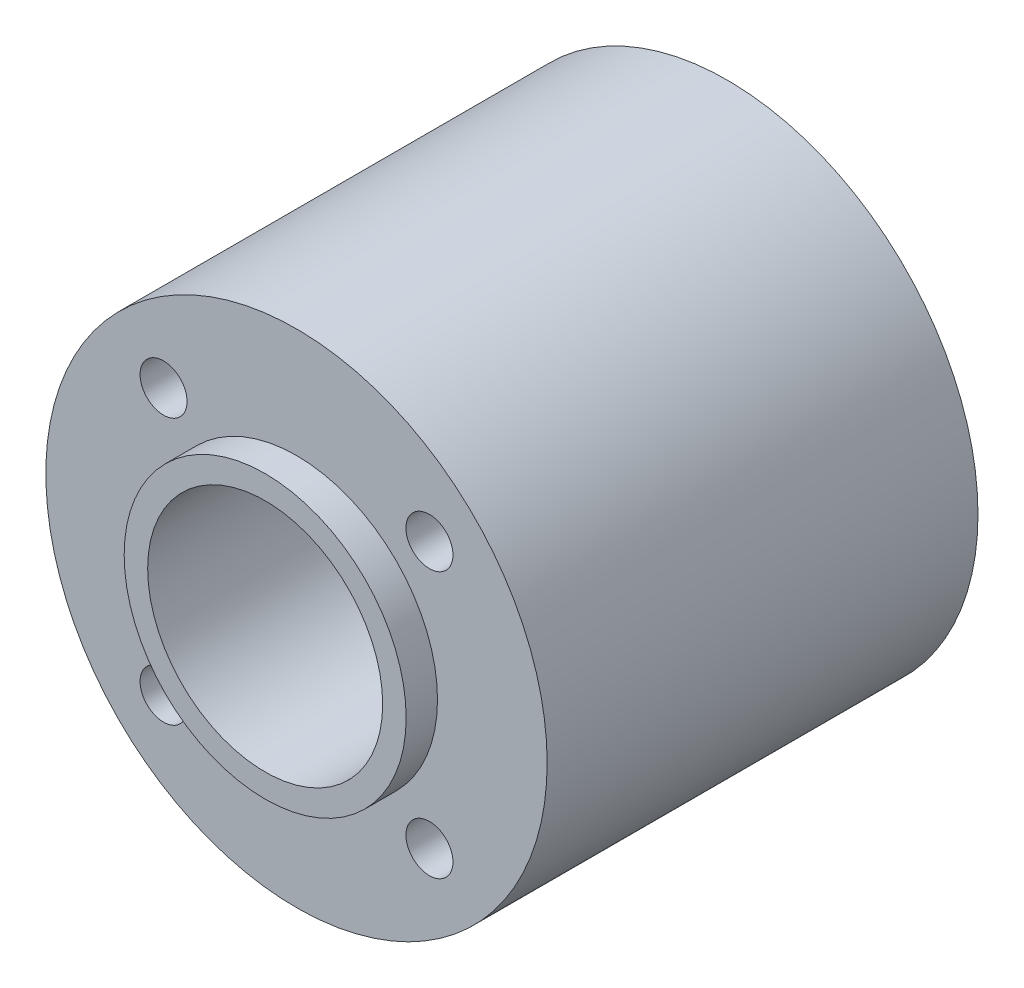
ISO-10303-21;
HEADER;
FILE_DESCRIPTION(('STEP AP214'),'2;1');
FILE_NAME('part.step','',(''),(''),'','','');
FILE_SCHEMA(('AUTOMOTIVE_DESIGN { 1 0 10303 214 1 1 1 1 }'));
ENDSEC;
DATA;
#1=APPLICATION_CONTEXT('core data for automotive mechanical design processes');
#2=APPLICATION_PROTOCOL_DEFINITION('international standard','automotive_design',2000,#1);
#3=PRODUCT_CONTEXT('',#1,'mechanical');
#4=PRODUCT('Part','Part','',(#3));
#5=PRODUCT_RELATED_PRODUCT_CATEGORY('part','',(#4));
#6=PRODUCT_DEFINITION_FORMATION('','',#4);
#7=PRODUCT_DEFINITION_CONTEXT('part definition',#1,'design');
#8=PRODUCT_DEFINITION('design','',#6,#7);
#9=PRODUCT_DEFINITION_SHAPE('','',#8);
#10=(LENGTH_UNIT() NAMED_UNIT(*) SI_UNIT(.MILLI.,.METRE.));
#11=(NAMED_UNIT(*) PLANE_ANGLE_UNIT() SI_UNIT($,.RADIAN.));
#12=(NAMED_UNIT(*) SI_UNIT($,.STERADIAN.) SOLID_ANGLE_UNIT());
#13=UNCERTAINTY_MEASURE_WITH_UNIT(LENGTH_MEASURE(1.E-05),#10,'distance_accuracy_value','');
#14=(GEOMETRIC_REPRESENTATION_CONTEXT(3) GLOBAL_UNCERTAINTY_ASSIGNED_CONTEXT((#13)) GLOBAL_UNIT_ASSIGNED_CONTEXT((#10,
#11,#12)) REPRESENTATION_CONTEXT('',''));
#15=CARTESIAN_POINT('',(0.,0.,0.));
#16=DIRECTION('',(0.,0.,1.));
#17=DIRECTION('',(1.,0.,0.));
#18=AXIS2_PLACEMENT_3D('',#15,#16,#17);
#19=CARTESIAN_POINT('',(1.28419105475315E-13,0.,41.25));
#20=DIRECTION('',(0.,0.,1.));
#21=DIRECTION('',(1.,0.,0.));
#22=AXIS2_PLACEMENT_3D('',#19,#20,#21);
#23=PLANE('',#22);
#24=CARTESIAN_POINT('',(1.28419105475315E-13,0.,41.25));
#25=DIRECTION('',(0.,0.,1.));
#26=DIRECTION('',(1.,0.,0.));
#27=AXIS2_PLACEMENT_3D('',#24,#25,#26);
#28=CIRCLE('',#27,18.);
#29=CARTESIAN_POINT('',(18.0000000000001,0.,41.25));
#30=VERTEX_POINT('',#29);
#31=EDGE_CURVE('E10',#30,#30,#28,.T.);
#32=ORIENTED_EDGE('',*,*,#31,.F.);
#33=EDGE_LOOP('',(#32));
#34=FACE_BOUND('',#33,.T.);
#35=CARTESIAN_POINT('',(16.9705627484781,-16.9705627484763,41.25));
#36=DIRECTION('',(0.,0.,1.));
#37=DIRECTION('',(1.,0.,0.));
#38=AXIS2_PLACEMENT_3D('',#35,#36,#37);
#39=CIRCLE('',#38,3.00000000000133);
#40=CARTESIAN_POINT('',(19.9705627484795,-16.9705627484763,41.25));
#41=VERTEX_POINT('',#40);
#42=EDGE_CURVE('E66',#41,#41,#39,.T.);
#43=ORIENTED_EDGE('',*,*,#42,.F.);
#44=EDGE_LOOP('',(#43));
#45=FACE_BOUND('',#44,.T.);
#46=CARTESIAN_POINT('',(-16.9705627484769,16.9705627484772,41.25));
#47=DIRECTION('',(0.,0.,1.));
#48=DIRECTION('',(1.,0.,0.));
#49=AXIS2_PLACEMENT_3D('',#46,#47,#48);
#50=CIRCLE('',#49,3.);
#51=CARTESIAN_POINT('',(-13.9705627484769,16.9705627484772,41.25));
#52=VERTEX_POINT('',#51);
#53=EDGE_CURVE('E82',#52,#52,#50,.T.);
#54=ORIENTED_EDGE('',*,*,#53,.F.);
#55=EDGE_LOOP('',(#54));
#56=FACE_BOUND('',#55,.T.);
#57=CARTESIAN_POINT('',(1.28419105475315E-13,0.,41.25));
#58=DIRECTION('',(0.,0.,1.));
#59=DIRECTION('',(1.,0.,0.));
#60=AXIS2_PLACEMENT_3D('',#57,#58,#59);
#61=CIRCLE('',#60,32.);
#62=CARTESIAN_POINT('',(32.0000000000001,0.,41.25));
#63=VERTEX_POINT('',#62);
#64=EDGE_CURVE('E45',#63,#63,#61,.T.);
#65=ORIENTED_EDGE('',*,*,#64,.T.);
#66=EDGE_LOOP('',(#65));
#67=FACE_BOUND('',#66,.T.);
#68=CARTESIAN_POINT('',(16.9705627484774,16.970562748478,41.25));
#69=DIRECTION('',(0.,0.,1.));
#70=DIRECTION('',(1.,0.,0.));
#71=AXIS2_PLACEMENT_3D('',#68,#69,#70);
#72=CIRCLE('',#71,3.00000000000098);
#73=CARTESIAN_POINT('',(19.9705627484783,16.970562748478,41.25));
#74=VERTEX_POINT('',#73);
#75=EDGE_CURVE('E74',#74,#74,#72,.T.);
#76=ORIENTED_EDGE('',*,*,#75,.F.);
#77=EDGE_LOOP('',(#76));
#78=FACE_BOUND('',#77,.T.);
#79=CARTESIAN_POINT('',(-16.9705627484761,-16.9705627484771,41.25));
#80=DIRECTION('',(0.,0.,1.));
#81=DIRECTION('',(1.,0.,0.));
#82=AXIS2_PLACEMENT_3D('',#79,#80,#81);
#83=CIRCLE('',#82,3.0000000000005);
#84=CARTESIAN_POINT('',(-13.9705627484756,-16.9705627484771,41.25));
#85=VERTEX_POINT('',#84);
#86=EDGE_CURVE('E57',#85,#85,#83,.T.);
#87=ORIENTED_EDGE('',*,*,#86,.F.);
#88=EDGE_LOOP('',(#87));
#89=FACE_BOUND('',#88,.T.);
#90=ADVANCED_FACE('F36',(#34,#45,#56,#67,#78,#89),#23,.T.);
#91=CARTESIAN_POINT('',(1.28419105475315E-13,0.,-13.75));
#92=DIRECTION('',(0.,0.,1.));
#93=DIRECTION('',(1.,0.,0.));
#94=AXIS2_PLACEMENT_3D('',#91,#92,#93);
#95=PLANE('',#94);
#96=CARTESIAN_POINT('',(1.28419105475315E-13,0.,-13.75));
#97=DIRECTION('',(0.,0.,1.));
#98=DIRECTION('',(1.,0.,0.));
#99=AXIS2_PLACEMENT_3D('',#96,#97,#98);
#100=CIRCLE('',#99,18.);
#101=CARTESIAN_POINT('',(18.0000000000001,0.,-13.75));
#102=VERTEX_POINT('',#101);
#103=EDGE_CURVE('E40',#102,#102,#100,.T.);
#104=ORIENTED_EDGE('',*,*,#103,.T.);
#105=EDGE_LOOP('',(#104));
#106=FACE_BOUND('',#105,.T.);
#107=CARTESIAN_POINT('',(1.28419105475315E-13,0.,-13.75));
#108=DIRECTION('',(0.,0.,1.));
#109=DIRECTION('',(1.,0.,0.));
#110=AXIS2_PLACEMENT_3D('',#107,#108,#109);
#111=CIRCLE('',#110,32.);
#112=CARTESIAN_POINT('',(32.0000000000001,0.,-13.75));
#113=VERTEX_POINT('',#112);
#114=EDGE_CURVE('E51',#113,#113,#111,.T.);
#115=ORIENTED_EDGE('',*,*,#114,.F.);
#116=EDGE_LOOP('',(#115));
#117=FACE_BOUND('',#116,.T.);
#118=CARTESIAN_POINT('',(-16.9705627484769,16.9705627484772,-13.75));
#119=DIRECTION('',(0.,0.,1.));
#120=DIRECTION('',(1.,0.,0.));
#121=AXIS2_PLACEMENT_3D('',#118,#119,#120);
#122=CIRCLE('',#121,3.);
#123=CARTESIAN_POINT('',(-13.9705627484769,16.9705627484772,-13.75));
#124=VERTEX_POINT('',#123);
#125=EDGE_CURVE('E78',#124,#124,#122,.T.);
#126=ORIENTED_EDGE('',*,*,#125,.T.);
#127=EDGE_LOOP('',(#126));
#128=FACE_BOUND('',#127,.T.);
#129=CARTESIAN_POINT('',(16.9705627484774,16.970562748478,-13.75));
#130=DIRECTION('',(0.,0.,1.));
#131=DIRECTION('',(1.,0.,0.));
#132=AXIS2_PLACEMENT_3D('',#129,#130,#131);
#133=CIRCLE('',#132,3.00000000000098);
#134=CARTESIAN_POINT('',(19.9705627484783,16.970562748478,-13.75));
#135=VERTEX_POINT('',#134);
#136=EDGE_CURVE('E70',#135,#135,#133,.T.);
#137=ORIENTED_EDGE('',*,*,#136,.T.);
#138=EDGE_LOOP('',(#137));
#139=FACE_BOUND('',#138,.T.);
#140=CARTESIAN_POINT('',(16.9705627484781,-16.9705627484763,-13.75));
#141=DIRECTION('',(0.,0.,1.));
#142=DIRECTION('',(1.,0.,0.));
#143=AXIS2_PLACEMENT_3D('',#140,#141,#142);
#144=CIRCLE('',#143,3.00000000000133);
#145=CARTESIAN_POINT('',(19.9705627484795,-16.9705627484763,-13.75));
#146=VERTEX_POINT('',#145);
#147=EDGE_CURVE('E61',#146,#146,#144,.T.);
#148=ORIENTED_EDGE('',*,*,#147,.T.);
#149=EDGE_LOOP('',(#148));
#150=FACE_BOUND('',#149,.T.);
#151=CARTESIAN_POINT('',(-16.9705627484761,-16.9705627484771,-13.75));
#152=DIRECTION('',(0.,0.,1.));
#153=DIRECTION('',(1.,0.,0.));
#154=AXIS2_PLACEMENT_3D('',#151,#152,#153);
#155=CIRCLE('',#154,3.0000000000005);
#156=CARTESIAN_POINT('',(-13.9705627484756,-16.9705627484771,-13.75));
#157=VERTEX_POINT('',#156);
#158=EDGE_CURVE('E62',#157,#157,#155,.T.);
#159=ORIENTED_EDGE('',*,*,#158,.T.);
#160=EDGE_LOOP('',(#159));
#161=FACE_BOUND('',#160,.T.);
#162=ADVANCED_FACE('F93',(#106,#117,#128,#139,#150,#161),#95,.F.);
#163=CARTESIAN_POINT('',(1.28419105475315E-13,0.,41.25));
#164=DIRECTION('',(0.,0.,-1.));
#165=DIRECTION('',(-1.,0.,0.));
#166=AXIS2_PLACEMENT_3D('',#163,#164,#165);
#167=CYLINDRICAL_SURFACE('',#166,32.);
#168=ORIENTED_EDGE('',*,*,#64,.F.);
#169=EDGE_LOOP('',(#168));
#170=FACE_BOUND('',#169,.T.);
#171=ORIENTED_EDGE('',*,*,#114,.T.);
#172=EDGE_LOOP('',(#171));
#173=FACE_BOUND('',#172,.T.);
#174=ADVANCED_FACE('F38',(#170,#173),#167,.T.);
#175=CARTESIAN_POINT('',(-16.9705627484769,16.9705627484772,41.25));
#176=DIRECTION('',(0.,0.,-1.));
#177=DIRECTION('',(-1.,0.,0.));
#178=AXIS2_PLACEMENT_3D('',#175,#176,#177);
#179=CYLINDRICAL_SURFACE('',#178,3.);
#180=ORIENTED_EDGE('',*,*,#53,.T.);
#181=EDGE_LOOP('',(#180));
#182=FACE_BOUND('',#181,.T.);
#183=ORIENTED_EDGE('',*,*,#125,.F.);
#184=EDGE_LOOP('',(#183));
#185=FACE_BOUND('',#184,.T.);
#186=ADVANCED_FACE('F133',(#182,#185),#179,.F.);
#187=CARTESIAN_POINT('',(16.9705627484774,16.970562748478,41.25));
#188=DIRECTION('',(0.,0.,-1.));
#189=DIRECTION('',(-1.,0.,0.));
#190=AXIS2_PLACEMENT_3D('',#187,#188,#189);
#191=CYLINDRICAL_SURFACE('',#190,3.00000000000098);
#192=ORIENTED_EDGE('',*,*,#75,.T.);
#193=EDGE_LOOP('',(#192));
#194=FACE_BOUND('',#193,.T.);
#195=ORIENTED_EDGE('',*,*,#136,.F.);
#196=EDGE_LOOP('',(#195));
#197=FACE_BOUND('',#196,.T.);
#198=ADVANCED_FACE('F119',(#194,#197),#191,.F.);
#199=CARTESIAN_POINT('',(16.9705627484781,-16.9705627484763,41.25));
#200=DIRECTION('',(0.,0.,-1.));
#201=DIRECTION('',(-1.,0.,0.));
#202=AXIS2_PLACEMENT_3D('',#199,#200,#201);
#203=CYLINDRICAL_SURFACE('',#202,3.00000000000133);
#204=ORIENTED_EDGE('',*,*,#42,.T.);
#205=EDGE_LOOP('',(#204));
#206=FACE_BOUND('',#205,.T.);
#207=ORIENTED_EDGE('',*,*,#147,.F.);
#208=EDGE_LOOP('',(#207));
#209=FACE_BOUND('',#208,.T.);
#210=ADVANCED_FACE('F108',(#206,#209),#203,.F.);
#211=CARTESIAN_POINT('',(-16.9705627484761,-16.9705627484771,41.25));
#212=DIRECTION('',(0.,0.,-1.));
#213=DIRECTION('',(-1.,0.,0.));
#214=AXIS2_PLACEMENT_3D('',#211,#212,#213);
#215=CYLINDRICAL_SURFACE('',#214,3.0000000000005);
#216=ORIENTED_EDGE('',*,*,#86,.T.);
#217=EDGE_LOOP('',(#216));
#218=FACE_BOUND('',#217,.T.);
#219=ORIENTED_EDGE('',*,*,#158,.F.);
#220=EDGE_LOOP('',(#219));
#221=FACE_BOUND('',#220,.T.);
#222=ADVANCED_FACE('F105',(#218,#221),#215,.F.);
#223=CARTESIAN_POINT('',(1.28419105475315E-13,0.,-17.75));
#224=DIRECTION('',(0.,0.,1.));
#225=DIRECTION('',(1.,0.,0.));
#226=AXIS2_PLACEMENT_3D('',#223,#224,#225);
#227=CYLINDRICAL_SURFACE('',#226,18.);
#228=CARTESIAN_POINT('',(1.28419105475315E-13,0.,-17.75));
#229=DIRECTION('',(0.,0.,1.));
#230=DIRECTION('',(1.,0.,0.));
#231=AXIS2_PLACEMENT_3D('',#228,#229,#230);
#232=CIRCLE('',#231,18.);
#233=CARTESIAN_POINT('',(18.0000000000001,0.,-17.75));
#234=VERTEX_POINT('',#233);
#235=EDGE_CURVE('E55',#234,#234,#232,.T.);
#236=ORIENTED_EDGE('',*,*,#235,.T.);
#237=EDGE_LOOP('',(#236));
#238=FACE_BOUND('',#237,.T.);
#239=ORIENTED_EDGE('',*,*,#103,.F.);
#240=EDGE_LOOP('',(#239));
#241=FACE_BOUND('',#240,.T.);
#242=ADVANCED_FACE('F107',(#238,#241),#227,.T.);
#243=CARTESIAN_POINT('',(1.28419105475315E-13,0.,-17.75));
#244=DIRECTION('',(0.,0.,1.));
#245=DIRECTION('',(1.,0.,0.));
#246=AXIS2_PLACEMENT_3D('',#243,#244,#245);
#247=PLANE('',#246);
#248=CARTESIAN_POINT('',(1.28419105475315E-13,0.,-17.75));
#249=DIRECTION('',(0.,0.,1.));
#250=DIRECTION('',(1.,0.,0.));
#251=AXIS2_PLACEMENT_3D('',#248,#249,#250);
#252=CIRCLE('',#251,15.);
#253=CARTESIAN_POINT('',(15.0000000000001,0.,-17.75));
#254=VERTEX_POINT('',#253);
#255=EDGE_CURVE('E238',#254,#254,#252,.T.);
#256=ORIENTED_EDGE('',*,*,#255,.T.);
#257=EDGE_LOOP('',(#256));
#258=FACE_BOUND('',#257,.T.);
#259=ORIENTED_EDGE('',*,*,#235,.F.);
#260=EDGE_LOOP('',(#259));
#261=FACE_BOUND('',#260,.T.);
#262=ADVANCED_FACE('F115',(#258,#261),#247,.F.);
#263=CARTESIAN_POINT('',(1.28419105475315E-13,0.,41.25));
#264=DIRECTION('',(0.,0.,-1.));
#265=DIRECTION('',(-1.,0.,0.));
#266=AXIS2_PLACEMENT_3D('',#263,#264,#265);
#267=CYLINDRICAL_SURFACE('',#266,15.);
#268=ORIENTED_EDGE('',*,*,#255,.F.);
#269=EDGE_LOOP('',(#268));
#270=FACE_BOUND('',#269,.T.);
#271=CARTESIAN_POINT('',(1.28419105475315E-13,0.,45.25));
#272=DIRECTION('',(0.,0.,1.));
#273=DIRECTION('',(1.,0.,0.));
#274=AXIS2_PLACEMENT_3D('',#271,#272,#273);
#275=CIRCLE('',#274,15.);
#276=CARTESIAN_POINT('',(15.0000000000001,0.,45.25));
#277=VERTEX_POINT('',#276);
#278=EDGE_CURVE('E233',#277,#277,#275,.T.);
#279=ORIENTED_EDGE('',*,*,#278,.T.);
#280=EDGE_LOOP('',(#279));
#281=FACE_BOUND('',#280,.T.);
#282=ADVANCED_FACE('F129',(#270,#281),#267,.F.);
#283=ORIENTED_EDGE('',*,*,#31,.T.);
#284=EDGE_LOOP('',(#283));
#285=FACE_BOUND('',#284,.T.);
#286=CARTESIAN_POINT('',(1.28419105475315E-13,0.,45.25));
#287=DIRECTION('',(0.,0.,1.));
#288=DIRECTION('',(1.,0.,0.));
#289=AXIS2_PLACEMENT_3D('',#286,#287,#288);
#290=CIRCLE('',#289,18.);
#291=CARTESIAN_POINT('',(18.0000000000001,0.,45.25));
#292=VERTEX_POINT('',#291);
#293=EDGE_CURVE('E230',#292,#292,#290,.T.);
#294=ORIENTED_EDGE('',*,*,#293,.F.);
#295=EDGE_LOOP('',(#294));
#296=FACE_BOUND('',#295,.T.);
#297=ADVANCED_FACE('F118',(#285,#296),#227,.T.);
#298=CARTESIAN_POINT('',(1.28419105475315E-13,0.,45.25));
#299=DIRECTION('',(0.,0.,1.));
#300=DIRECTION('',(1.,0.,0.));
#301=AXIS2_PLACEMENT_3D('',#298,#299,#300);
#302=PLANE('',#301);
#303=ORIENTED_EDGE('',*,*,#293,.T.);
#304=EDGE_LOOP('',(#303));
#305=FACE_BOUND('',#304,.T.);
#306=ORIENTED_EDGE('',*,*,#278,.F.);
#307=EDGE_LOOP('',(#306));
#308=FACE_BOUND('',#307,.T.);
#309=ADVANCED_FACE('F191',(#305,#308),#302,.T.);
#310=CLOSED_SHELL('',(#90,#162,#174,#186,#198,#210,#222,#242,#262,#282,#297,#309));
#311=MANIFOLD_SOLID_BREP('B2',#310);
#312=ADVANCED_BREP_SHAPE_REPRESENTATION('',(#18,#311),#14);
#313=SHAPE_DEFINITION_REPRESENTATION(#9,#312);
ENDSEC;
END-ISO-10303-21;
